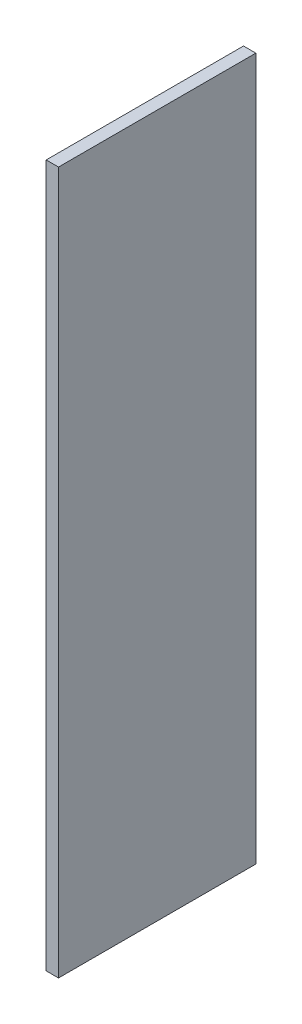
ISO-10303-21;
HEADER;
FILE_DESCRIPTION(('STEP AP214'),'2;1');
FILE_NAME('part.step','',(''),(''),'','','');
FILE_SCHEMA(('AUTOMOTIVE_DESIGN { 1 0 10303 214 1 1 1 1 }'));
ENDSEC;
DATA;
#1=APPLICATION_CONTEXT('core data for automotive mechanical design processes');
#2=APPLICATION_PROTOCOL_DEFINITION('international standard','automotive_design',2000,#1);
#3=PRODUCT_CONTEXT('',#1,'mechanical');
#4=PRODUCT('Part','Part','',(#3));
#5=PRODUCT_RELATED_PRODUCT_CATEGORY('part','',(#4));
#6=PRODUCT_DEFINITION_FORMATION('','',#4);
#7=PRODUCT_DEFINITION_CONTEXT('part definition',#1,'design');
#8=PRODUCT_DEFINITION('design','',#6,#7);
#9=PRODUCT_DEFINITION_SHAPE('','',#8);
#10=(LENGTH_UNIT() NAMED_UNIT(*) SI_UNIT(.MILLI.,.METRE.));
#11=(NAMED_UNIT(*) PLANE_ANGLE_UNIT() SI_UNIT($,.RADIAN.));
#12=(NAMED_UNIT(*) SI_UNIT($,.STERADIAN.) SOLID_ANGLE_UNIT());
#13=UNCERTAINTY_MEASURE_WITH_UNIT(LENGTH_MEASURE(1.E-05),#10,'distance_accuracy_value','');
#14=(GEOMETRIC_REPRESENTATION_CONTEXT(3) GLOBAL_UNCERTAINTY_ASSIGNED_CONTEXT((#13)) GLOBAL_UNIT_ASSIGNED_CONTEXT((#10,
#11,#12)) REPRESENTATION_CONTEXT('',''));
#15=CARTESIAN_POINT('',(0.,0.,0.));
#16=DIRECTION('',(0.,0.,1.));
#17=DIRECTION('',(1.,0.,0.));
#18=AXIS2_PLACEMENT_3D('',#15,#16,#17);
#19=CARTESIAN_POINT('',(18.,-967.219556499024,267.607933188847));
#20=DIRECTION('',(0.,0.,-1.));
#21=DIRECTION('',(-1.,0.,0.));
#22=AXIS2_PLACEMENT_3D('',#19,#20,#21);
#23=PLANE('',#22);
#24=DIRECTION('',(0.,-1.,0.));
#25=VECTOR('',#24,1.);
#26=CARTESIAN_POINT('',(0.,-967.219556499024,267.607933188847));
#27=LINE('',#26,#25);
#28=CARTESIAN_POINT('',(0.,57.7804435009756,267.607933188847));
#29=VERTEX_POINT('',#28);
#30=CARTESIAN_POINT('',(0.,-967.219556499024,267.607933188847));
#31=VERTEX_POINT('',#30);
#32=EDGE_CURVE('E96',#29,#31,#27,.T.);
#33=ORIENTED_EDGE('',*,*,#32,.T.);
#34=DIRECTION('',(-1.,0.,0.));
#35=VECTOR('',#34,1.);
#36=CARTESIAN_POINT('',(18.,-967.219556499024,267.607933188847));
#37=LINE('',#36,#35);
#38=CARTESIAN_POINT('',(18.,-967.219556499024,267.607933188847));
#39=VERTEX_POINT('',#38);
#40=EDGE_CURVE('E11',#39,#31,#37,.T.);
#41=ORIENTED_EDGE('',*,*,#40,.F.);
#42=DIRECTION('',(0.,-1.,0.));
#43=VECTOR('',#42,1.);
#44=CARTESIAN_POINT('',(18.,-967.219556499024,267.607933188847));
#45=LINE('',#44,#43);
#46=CARTESIAN_POINT('',(18.,57.7804435009756,267.607933188847));
#47=VERTEX_POINT('',#46);
#48=EDGE_CURVE('E84',#47,#39,#45,.T.);
#49=ORIENTED_EDGE('',*,*,#48,.F.);
#50=DIRECTION('',(-1.,0.,0.));
#51=VECTOR('',#50,1.);
#52=CARTESIAN_POINT('',(18.,57.7804435009756,267.607933188847));
#53=LINE('',#52,#51);
#54=EDGE_CURVE('E92',#47,#29,#53,.T.);
#55=ORIENTED_EDGE('',*,*,#54,.T.);
#56=EDGE_LOOP('',(#33,#41,#49,#55));
#57=FACE_BOUND('',#56,.T.);
#58=ADVANCED_FACE('F33',(#57),#23,.F.);
#59=CARTESIAN_POINT('',(18.,-967.219556499024,-20.392066811153));
#60=DIRECTION('',(0.,1.,0.));
#61=DIRECTION('',(0.,0.,1.));
#62=AXIS2_PLACEMENT_3D('',#59,#60,#61);
#63=PLANE('',#62);
#64=DIRECTION('',(0.,0.,-1.));
#65=VECTOR('',#64,1.);
#66=CARTESIAN_POINT('',(0.,-967.219556499024,-20.392066811153));
#67=LINE('',#66,#65);
#68=CARTESIAN_POINT('',(0.,-967.219556499024,-20.392066811153));
#69=VERTEX_POINT('',#68);
#70=EDGE_CURVE('E88',#31,#69,#67,.T.);
#71=ORIENTED_EDGE('',*,*,#70,.T.);
#72=DIRECTION('',(-1.,0.,0.));
#73=VECTOR('',#72,1.);
#74=CARTESIAN_POINT('',(18.,-967.219556499024,-20.392066811153));
#75=LINE('',#74,#73);
#76=CARTESIAN_POINT('',(18.,-967.219556499024,-20.392066811153));
#77=VERTEX_POINT('',#76);
#78=EDGE_CURVE('E41',#77,#69,#75,.T.);
#79=ORIENTED_EDGE('',*,*,#78,.F.);
#80=DIRECTION('',(0.,0.,-1.));
#81=VECTOR('',#80,1.);
#82=CARTESIAN_POINT('',(18.,-967.219556499024,-20.392066811153));
#83=LINE('',#82,#81);
#84=EDGE_CURVE('E79',#39,#77,#83,.T.);
#85=ORIENTED_EDGE('',*,*,#84,.F.);
#86=ORIENTED_EDGE('',*,*,#40,.T.);
#87=EDGE_LOOP('',(#71,#79,#85,#86));
#88=FACE_BOUND('',#87,.T.);
#89=ADVANCED_FACE('F87',(#88),#63,.F.);
#90=CARTESIAN_POINT('',(18.,-967.219556499024,-20.392066811153));
#91=DIRECTION('',(0.,0.,1.));
#92=DIRECTION('',(1.,0.,0.));
#93=AXIS2_PLACEMENT_3D('',#90,#91,#92);
#94=PLANE('',#93);
#95=DIRECTION('',(0.,1.,0.));
#96=VECTOR('',#95,1.);
#97=CARTESIAN_POINT('',(0.,-967.219556499024,-20.392066811153));
#98=LINE('',#97,#96);
#99=CARTESIAN_POINT('',(0.,57.7804435009756,-20.392066811153));
#100=VERTEX_POINT('',#99);
#101=EDGE_CURVE('E66',#69,#100,#98,.T.);
#102=ORIENTED_EDGE('',*,*,#101,.T.);
#103=DIRECTION('',(-1.,0.,0.));
#104=VECTOR('',#103,1.);
#105=CARTESIAN_POINT('',(18.,57.7804435009756,-20.392066811153));
#106=LINE('',#105,#104);
#107=CARTESIAN_POINT('',(18.,57.7804435009756,-20.392066811153));
#108=VERTEX_POINT('',#107);
#109=EDGE_CURVE('E89',#108,#100,#106,.T.);
#110=ORIENTED_EDGE('',*,*,#109,.F.);
#111=DIRECTION('',(0.,1.,0.));
#112=VECTOR('',#111,1.);
#113=CARTESIAN_POINT('',(18.,-967.219556499024,-20.392066811153));
#114=LINE('',#113,#112);
#115=EDGE_CURVE('E82',#77,#108,#114,.T.);
#116=ORIENTED_EDGE('',*,*,#115,.F.);
#117=ORIENTED_EDGE('',*,*,#78,.T.);
#118=EDGE_LOOP('',(#102,#110,#116,#117));
#119=FACE_BOUND('',#118,.T.);
#120=ADVANCED_FACE('F90',(#119),#94,.F.);
#121=CARTESIAN_POINT('',(18.,57.7804435009756,-20.392066811153));
#122=DIRECTION('',(0.,-1.,0.));
#123=DIRECTION('',(0.,0.,-1.));
#124=AXIS2_PLACEMENT_3D('',#121,#122,#123);
#125=PLANE('',#124);
#126=DIRECTION('',(0.,0.,1.));
#127=VECTOR('',#126,1.);
#128=CARTESIAN_POINT('',(0.,57.7804435009756,-20.392066811153));
#129=LINE('',#128,#127);
#130=EDGE_CURVE('E72',#100,#29,#129,.T.);
#131=ORIENTED_EDGE('',*,*,#130,.T.);
#132=ORIENTED_EDGE('',*,*,#54,.F.);
#133=DIRECTION('',(0.,0.,1.));
#134=VECTOR('',#133,1.);
#135=CARTESIAN_POINT('',(18.,57.7804435009756,-20.392066811153));
#136=LINE('',#135,#134);
#137=EDGE_CURVE('E49',#108,#47,#136,.T.);
#138=ORIENTED_EDGE('',*,*,#137,.F.);
#139=ORIENTED_EDGE('',*,*,#109,.T.);
#140=EDGE_LOOP('',(#131,#132,#138,#139));
#141=FACE_BOUND('',#140,.T.);
#142=ADVANCED_FACE('F103',(#141),#125,.F.);
#143=CARTESIAN_POINT('',(18.,0.,0.));
#144=DIRECTION('',(1.,0.,0.));
#145=DIRECTION('',(0.,0.,-1.));
#146=AXIS2_PLACEMENT_3D('',#143,#144,#145);
#147=PLANE('',#146);
#148=ORIENTED_EDGE('',*,*,#48,.T.);
#149=ORIENTED_EDGE('',*,*,#84,.T.);
#150=ORIENTED_EDGE('',*,*,#115,.T.);
#151=ORIENTED_EDGE('',*,*,#137,.T.);
#152=EDGE_LOOP('',(#148,#149,#150,#151));
#153=FACE_BOUND('',#152,.T.);
#154=ADVANCED_FACE('F80',(#153),#147,.T.);
#155=CARTESIAN_POINT('',(0.,0.,0.));
#156=DIRECTION('',(1.,0.,0.));
#157=DIRECTION('',(0.,0.,-1.));
#158=AXIS2_PLACEMENT_3D('',#155,#156,#157);
#159=PLANE('',#158);
#160=ORIENTED_EDGE('',*,*,#32,.F.);
#161=ORIENTED_EDGE('',*,*,#130,.F.);
#162=ORIENTED_EDGE('',*,*,#101,.F.);
#163=ORIENTED_EDGE('',*,*,#70,.F.);
#164=EDGE_LOOP('',(#160,#161,#162,#163));
#165=FACE_BOUND('',#164,.T.);
#166=ADVANCED_FACE('F106',(#165),#159,.F.);
#167=CLOSED_SHELL('',(#58,#89,#120,#142,#154,#166));
#168=MANIFOLD_SOLID_BREP('B2',#167);
#169=ADVANCED_BREP_SHAPE_REPRESENTATION('',(#18,#168),#14);
#170=SHAPE_DEFINITION_REPRESENTATION(#9,#169);
ENDSEC;
END-ISO-10303-21;
